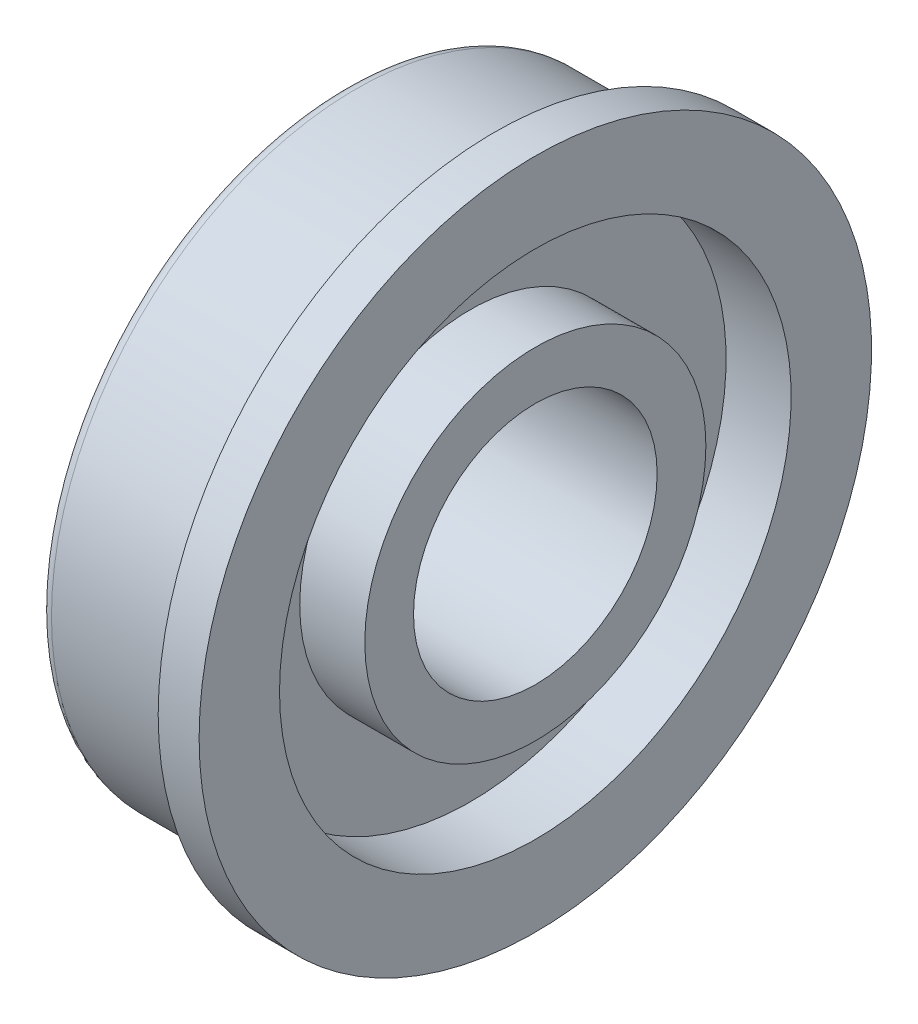
ISO-10303-21;
HEADER;
FILE_DESCRIPTION(('STEP AP214'),'2;1');
FILE_NAME('part.step','',(''),(''),'','','');
FILE_SCHEMA(('AUTOMOTIVE_DESIGN { 1 0 10303 214 1 1 1 1 }'));
ENDSEC;
DATA;
#1=APPLICATION_CONTEXT('core data for automotive mechanical design processes');
#2=APPLICATION_PROTOCOL_DEFINITION('international standard','automotive_design',2000,#1);
#3=PRODUCT_CONTEXT('',#1,'mechanical');
#4=PRODUCT('Part','Part','',(#3));
#5=PRODUCT_RELATED_PRODUCT_CATEGORY('part','',(#4));
#6=PRODUCT_DEFINITION_FORMATION('','',#4);
#7=PRODUCT_DEFINITION_CONTEXT('part definition',#1,'design');
#8=PRODUCT_DEFINITION('design','',#6,#7);
#9=PRODUCT_DEFINITION_SHAPE('','',#8);
#10=(LENGTH_UNIT() NAMED_UNIT(*) SI_UNIT(.MILLI.,.METRE.));
#11=(NAMED_UNIT(*) PLANE_ANGLE_UNIT() SI_UNIT($,.RADIAN.));
#12=(NAMED_UNIT(*) SI_UNIT($,.STERADIAN.) SOLID_ANGLE_UNIT());
#13=UNCERTAINTY_MEASURE_WITH_UNIT(LENGTH_MEASURE(1.E-05),#10,'distance_accuracy_value','');
#14=(GEOMETRIC_REPRESENTATION_CONTEXT(3) GLOBAL_UNCERTAINTY_ASSIGNED_CONTEXT((#13)) GLOBAL_UNIT_ASSIGNED_CONTEXT((#10,
#11,#12)) REPRESENTATION_CONTEXT('',''));
#15=CARTESIAN_POINT('',(0.,0.,0.));
#16=DIRECTION('',(0.,0.,1.));
#17=DIRECTION('',(1.,0.,0.));
#18=AXIS2_PLACEMENT_3D('',#15,#16,#17);
#19=CARTESIAN_POINT('',(4.9784,3.175,0.));
#20=DIRECTION('',(-1.,0.,0.));
#21=DIRECTION('',(0.,0.,1.));
#22=AXIS2_PLACEMENT_3D('',#19,#20,#21);
#23=PLANE('',#22);
#24=CARTESIAN_POINT('',(4.9784,0.,0.));
#25=DIRECTION('',(-1.,0.,0.));
#26=DIRECTION('',(0.,0.,1.));
#27=AXIS2_PLACEMENT_3D('',#24,#25,#26);
#28=CIRCLE('',#27,4.445);
#29=CARTESIAN_POINT('',(4.9784,0.,4.445));
#30=VERTEX_POINT('',#29);
#31=EDGE_CURVE('E10',#30,#30,#28,.T.);
#32=ORIENTED_EDGE('',*,*,#31,.F.);
#33=EDGE_LOOP('',(#32));
#34=FACE_BOUND('',#33,.T.);
#35=CARTESIAN_POINT('',(4.9784,0.,0.));
#36=DIRECTION('',(-1.,0.,0.));
#37=DIRECTION('',(0.,0.,1.));
#38=AXIS2_PLACEMENT_3D('',#35,#36,#37);
#39=CIRCLE('',#38,3.175);
#40=CARTESIAN_POINT('',(4.9784,0.,3.175));
#41=VERTEX_POINT('',#40);
#42=EDGE_CURVE('E85',#41,#41,#39,.T.);
#43=ORIENTED_EDGE('',*,*,#42,.T.);
#44=EDGE_LOOP('',(#43));
#45=FACE_BOUND('',#44,.T.);
#46=ADVANCED_FACE('F33',(#34,#45),#23,.F.);
#47=CARTESIAN_POINT('',(-4.8320583682069,0.,0.));
#48=DIRECTION('',(-1.,0.,0.));
#49=DIRECTION('',(0.,0.,1.));
#50=AXIS2_PLACEMENT_3D('',#47,#48,#49);
#51=CYLINDRICAL_SURFACE('',#50,4.445);
#52=CARTESIAN_POINT('',(3.28295,0.,0.));
#53=DIRECTION('',(-1.,0.,0.));
#54=DIRECTION('',(0.,0.,1.));
#55=AXIS2_PLACEMENT_3D('',#52,#53,#54);
#56=CIRCLE('',#55,4.445);
#57=CARTESIAN_POINT('',(3.28295,0.,4.445));
#58=VERTEX_POINT('',#57);
#59=EDGE_CURVE('E39',#58,#58,#56,.T.);
#60=ORIENTED_EDGE('',*,*,#59,.F.);
#61=EDGE_LOOP('',(#60));
#62=FACE_BOUND('',#61,.T.);
#63=ORIENTED_EDGE('',*,*,#31,.T.);
#64=EDGE_LOOP('',(#63));
#65=FACE_BOUND('',#64,.T.);
#66=ADVANCED_FACE('F170',(#62,#65),#51,.T.);
#67=CARTESIAN_POINT('',(3.28295,4.445,0.));
#68=DIRECTION('',(-1.,0.,0.));
#69=DIRECTION('',(0.,0.,1.));
#70=AXIS2_PLACEMENT_3D('',#67,#68,#69);
#71=PLANE('',#70);
#72=CARTESIAN_POINT('',(3.28295,0.,0.));
#73=DIRECTION('',(-1.,0.,0.));
#74=DIRECTION('',(0.,0.,1.));
#75=AXIS2_PLACEMENT_3D('',#72,#73,#74);
#76=CIRCLE('',#75,6.6675);
#77=CARTESIAN_POINT('',(3.28295,0.,6.6675));
#78=VERTEX_POINT('',#77);
#79=EDGE_CURVE('E43',#78,#78,#76,.T.);
#80=ORIENTED_EDGE('',*,*,#79,.F.);
#81=EDGE_LOOP('',(#80));
#82=FACE_BOUND('',#81,.T.);
#83=ORIENTED_EDGE('',*,*,#59,.T.);
#84=EDGE_LOOP('',(#83));
#85=FACE_BOUND('',#84,.T.);
#86=ADVANCED_FACE('F165',(#82,#85),#71,.F.);
#87=CARTESIAN_POINT('',(-4.8320583682069,0.,0.));
#88=DIRECTION('',(-1.,0.,0.));
#89=DIRECTION('',(0.,0.,1.));
#90=AXIS2_PLACEMENT_3D('',#87,#88,#89);
#91=CYLINDRICAL_SURFACE('',#90,6.6675);
#92=CARTESIAN_POINT('',(4.9784,0.,0.));
#93=DIRECTION('',(-1.,0.,0.));
#94=DIRECTION('',(0.,0.,1.));
#95=AXIS2_PLACEMENT_3D('',#92,#93,#94);
#96=CIRCLE('',#95,6.6675);
#97=CARTESIAN_POINT('',(4.9784,0.,6.6675));
#98=VERTEX_POINT('',#97);
#99=EDGE_CURVE('E47',#98,#98,#96,.T.);
#100=ORIENTED_EDGE('',*,*,#99,.F.);
#101=EDGE_LOOP('',(#100));
#102=FACE_BOUND('',#101,.T.);
#103=ORIENTED_EDGE('',*,*,#79,.T.);
#104=EDGE_LOOP('',(#103));
#105=FACE_BOUND('',#104,.T.);
#106=ADVANCED_FACE('F159',(#102,#105),#91,.F.);
#107=CARTESIAN_POINT('',(4.9784,6.6675,0.));
#108=DIRECTION('',(-1.,0.,0.));
#109=DIRECTION('',(0.,0.,1.));
#110=AXIS2_PLACEMENT_3D('',#107,#108,#109);
#111=PLANE('',#110);
#112=CARTESIAN_POINT('',(4.9784,0.,0.));
#113=DIRECTION('',(-1.,0.,0.));
#114=DIRECTION('',(0.,0.,1.));
#115=AXIS2_PLACEMENT_3D('',#112,#113,#114);
#116=CIRCLE('',#115,8.763);
#117=CARTESIAN_POINT('',(4.9784,0.,8.763));
#118=VERTEX_POINT('',#117);
#119=EDGE_CURVE('E52',#118,#118,#116,.T.);
#120=ORIENTED_EDGE('',*,*,#119,.F.);
#121=EDGE_LOOP('',(#120));
#122=FACE_BOUND('',#121,.T.);
#123=ORIENTED_EDGE('',*,*,#99,.T.);
#124=EDGE_LOOP('',(#123));
#125=FACE_BOUND('',#124,.T.);
#126=ADVANCED_FACE('F153',(#122,#125),#111,.F.);
#127=CARTESIAN_POINT('',(-4.8320583682069,0.,0.));
#128=DIRECTION('',(-1.,0.,0.));
#129=DIRECTION('',(0.,0.,1.));
#130=AXIS2_PLACEMENT_3D('',#127,#128,#129);
#131=CYLINDRICAL_SURFACE('',#130,8.763);
#132=CARTESIAN_POINT('',(3.9116,0.,0.));
#133=DIRECTION('',(-1.,0.,0.));
#134=DIRECTION('',(0.,0.,1.));
#135=AXIS2_PLACEMENT_3D('',#132,#133,#134);
#136=CIRCLE('',#135,8.76299999999999);
#137=CARTESIAN_POINT('',(3.9116,0.,8.76299999999999));
#138=VERTEX_POINT('',#137);
#139=EDGE_CURVE('E55',#138,#138,#136,.T.);
#140=ORIENTED_EDGE('',*,*,#139,.F.);
#141=EDGE_LOOP('',(#140));
#142=FACE_BOUND('',#141,.T.);
#143=ORIENTED_EDGE('',*,*,#119,.T.);
#144=EDGE_LOOP('',(#143));
#145=FACE_BOUND('',#144,.T.);
#146=ADVANCED_FACE('F147',(#142,#145),#131,.T.);
#147=CARTESIAN_POINT('',(3.9116,8.76299999999999,0.));
#148=DIRECTION('',(1.,0.,0.));
#149=DIRECTION('',(0.,0.,-1.));
#150=AXIS2_PLACEMENT_3D('',#147,#148,#149);
#151=PLANE('',#150);
#152=CARTESIAN_POINT('',(3.9116,0.,0.));
#153=DIRECTION('',(-1.,0.,0.));
#154=DIRECTION('',(0.,0.,1.));
#155=AXIS2_PLACEMENT_3D('',#152,#153,#154);
#156=CIRCLE('',#155,7.9375);
#157=CARTESIAN_POINT('',(3.9116,0.,7.9375));
#158=VERTEX_POINT('',#157);
#159=EDGE_CURVE('E58',#158,#158,#156,.T.);
#160=ORIENTED_EDGE('',*,*,#159,.F.);
#161=EDGE_LOOP('',(#160));
#162=FACE_BOUND('',#161,.T.);
#163=ORIENTED_EDGE('',*,*,#139,.T.);
#164=EDGE_LOOP('',(#163));
#165=FACE_BOUND('',#164,.T.);
#166=ADVANCED_FACE('F141',(#162,#165),#151,.F.);
#167=CARTESIAN_POINT('',(-4.8320583682069,0.,0.));
#168=DIRECTION('',(-1.,0.,0.));
#169=DIRECTION('',(0.,0.,1.));
#170=AXIS2_PLACEMENT_3D('',#167,#168,#169);
#171=CYLINDRICAL_SURFACE('',#170,7.9375);
#172=CARTESIAN_POINT('',(0.304799999999999,0.,0.));
#173=DIRECTION('',(-1.,0.,0.));
#174=DIRECTION('',(0.,0.,1.));
#175=AXIS2_PLACEMENT_3D('',#172,#173,#174);
#176=CIRCLE('',#175,7.9375);
#177=CARTESIAN_POINT('',(0.304799999999999,0.,7.9375));
#178=VERTEX_POINT('',#177);
#179=EDGE_CURVE('E61',#178,#178,#176,.T.);
#180=ORIENTED_EDGE('',*,*,#179,.F.);
#181=EDGE_LOOP('',(#180));
#182=FACE_BOUND('',#181,.T.);
#183=ORIENTED_EDGE('',*,*,#159,.T.);
#184=EDGE_LOOP('',(#183));
#185=FACE_BOUND('',#184,.T.);
#186=ADVANCED_FACE('F135',(#182,#185),#171,.T.);
#187=CARTESIAN_POINT('',(0.304799999999999,0.,0.));
#188=DIRECTION('',(-1.,0.,0.));
#189=DIRECTION('',(0.,0.,1.));
#190=AXIS2_PLACEMENT_3D('',#187,#188,#189);
#191=TOROIDAL_SURFACE('',#190,7.6327,0.304799999999998);
#192=CARTESIAN_POINT('',(0.,0.,0.));
#193=DIRECTION('',(-1.,0.,0.));
#194=DIRECTION('',(0.,0.,1.));
#195=AXIS2_PLACEMENT_3D('',#192,#193,#194);
#196=CIRCLE('',#195,7.6327);
#197=CARTESIAN_POINT('',(0.,0.,7.6327));
#198=VERTEX_POINT('',#197);
#199=EDGE_CURVE('E64',#198,#198,#196,.T.);
#200=ORIENTED_EDGE('',*,*,#199,.F.);
#201=EDGE_LOOP('',(#200));
#202=FACE_BOUND('',#201,.T.);
#203=ORIENTED_EDGE('',*,*,#179,.T.);
#204=EDGE_LOOP('',(#203));
#205=FACE_BOUND('',#204,.T.);
#206=ADVANCED_FACE('F129',(#202,#205),#191,.T.);
#207=CARTESIAN_POINT('',(0.,7.6327,0.));
#208=DIRECTION('',(1.,0.,0.));
#209=DIRECTION('',(0.,0.,-1.));
#210=AXIS2_PLACEMENT_3D('',#207,#208,#209);
#211=PLANE('',#210);
#212=CARTESIAN_POINT('',(0.,0.,0.));
#213=DIRECTION('',(-1.,0.,0.));
#214=DIRECTION('',(0.,0.,1.));
#215=AXIS2_PLACEMENT_3D('',#212,#213,#214);
#216=CIRCLE('',#215,6.6675);
#217=CARTESIAN_POINT('',(0.,0.,6.6675));
#218=VERTEX_POINT('',#217);
#219=EDGE_CURVE('E67',#218,#218,#216,.T.);
#220=ORIENTED_EDGE('',*,*,#219,.F.);
#221=EDGE_LOOP('',(#220));
#222=FACE_BOUND('',#221,.T.);
#223=ORIENTED_EDGE('',*,*,#199,.T.);
#224=EDGE_LOOP('',(#223));
#225=FACE_BOUND('',#224,.T.);
#226=ADVANCED_FACE('F123',(#222,#225),#211,.F.);
#227=CARTESIAN_POINT('',(-4.8320583682069,0.,0.));
#228=DIRECTION('',(-1.,0.,0.));
#229=DIRECTION('',(0.,0.,1.));
#230=AXIS2_PLACEMENT_3D('',#227,#228,#229);
#231=CYLINDRICAL_SURFACE('',#230,6.6675);
#232=CARTESIAN_POINT('',(1.69545,0.,0.));
#233=DIRECTION('',(-1.,0.,0.));
#234=DIRECTION('',(0.,0.,1.));
#235=AXIS2_PLACEMENT_3D('',#232,#233,#234);
#236=CIRCLE('',#235,6.6675);
#237=CARTESIAN_POINT('',(1.69545,0.,6.6675));
#238=VERTEX_POINT('',#237);
#239=EDGE_CURVE('E70',#238,#238,#236,.T.);
#240=ORIENTED_EDGE('',*,*,#239,.F.);
#241=EDGE_LOOP('',(#240));
#242=FACE_BOUND('',#241,.T.);
#243=ORIENTED_EDGE('',*,*,#219,.T.);
#244=EDGE_LOOP('',(#243));
#245=FACE_BOUND('',#244,.T.);
#246=ADVANCED_FACE('F117',(#242,#245),#231,.F.);
#247=CARTESIAN_POINT('',(1.69545,6.6675,0.));
#248=DIRECTION('',(1.,0.,0.));
#249=DIRECTION('',(0.,0.,-1.));
#250=AXIS2_PLACEMENT_3D('',#247,#248,#249);
#251=PLANE('',#250);
#252=CARTESIAN_POINT('',(1.69545,0.,0.));
#253=DIRECTION('',(-1.,0.,0.));
#254=DIRECTION('',(0.,0.,1.));
#255=AXIS2_PLACEMENT_3D('',#252,#253,#254);
#256=CIRCLE('',#255,4.445);
#257=CARTESIAN_POINT('',(1.69545,0.,4.445));
#258=VERTEX_POINT('',#257);
#259=EDGE_CURVE('E73',#258,#258,#256,.T.);
#260=ORIENTED_EDGE('',*,*,#259,.F.);
#261=EDGE_LOOP('',(#260));
#262=FACE_BOUND('',#261,.T.);
#263=ORIENTED_EDGE('',*,*,#239,.T.);
#264=EDGE_LOOP('',(#263));
#265=FACE_BOUND('',#264,.T.);
#266=ADVANCED_FACE('F111',(#262,#265),#251,.F.);
#267=CARTESIAN_POINT('',(-4.8320583682069,0.,0.));
#268=DIRECTION('',(-1.,0.,0.));
#269=DIRECTION('',(0.,0.,1.));
#270=AXIS2_PLACEMENT_3D('',#267,#268,#269);
#271=CYLINDRICAL_SURFACE('',#270,4.445);
#272=CARTESIAN_POINT('',(0.,0.,0.));
#273=DIRECTION('',(-1.,0.,0.));
#274=DIRECTION('',(0.,0.,1.));
#275=AXIS2_PLACEMENT_3D('',#272,#273,#274);
#276=CIRCLE('',#275,4.445);
#277=CARTESIAN_POINT('',(0.,0.,4.445));
#278=VERTEX_POINT('',#277);
#279=EDGE_CURVE('E76',#278,#278,#276,.T.);
#280=ORIENTED_EDGE('',*,*,#279,.F.);
#281=EDGE_LOOP('',(#280));
#282=FACE_BOUND('',#281,.T.);
#283=ORIENTED_EDGE('',*,*,#259,.T.);
#284=EDGE_LOOP('',(#283));
#285=FACE_BOUND('',#284,.T.);
#286=ADVANCED_FACE('F105',(#282,#285),#271,.T.);
#287=CARTESIAN_POINT('',(0.,4.445,0.));
#288=DIRECTION('',(1.,0.,0.));
#289=DIRECTION('',(0.,0.,-1.));
#290=AXIS2_PLACEMENT_3D('',#287,#288,#289);
#291=PLANE('',#290);
#292=CARTESIAN_POINT('',(0.,0.,0.));
#293=DIRECTION('',(-1.,0.,0.));
#294=DIRECTION('',(0.,0.,1.));
#295=AXIS2_PLACEMENT_3D('',#292,#293,#294);
#296=CIRCLE('',#295,3.4798);
#297=CARTESIAN_POINT('',(0.,0.,3.4798));
#298=VERTEX_POINT('',#297);
#299=EDGE_CURVE('E79',#298,#298,#296,.T.);
#300=ORIENTED_EDGE('',*,*,#299,.F.);
#301=EDGE_LOOP('',(#300));
#302=FACE_BOUND('',#301,.T.);
#303=ORIENTED_EDGE('',*,*,#279,.T.);
#304=EDGE_LOOP('',(#303));
#305=FACE_BOUND('',#304,.T.);
#306=ADVANCED_FACE('F99',(#302,#305),#291,.F.);
#307=CARTESIAN_POINT('',(0.3048,0.,0.));
#308=DIRECTION('',(-1.,0.,0.));
#309=DIRECTION('',(0.,0.,1.));
#310=AXIS2_PLACEMENT_3D('',#307,#308,#309);
#311=TOROIDAL_SURFACE('',#310,3.4798,0.3048);
#312=CARTESIAN_POINT('',(0.3048,0.,0.));
#313=DIRECTION('',(-1.,0.,0.));
#314=DIRECTION('',(0.,0.,1.));
#315=AXIS2_PLACEMENT_3D('',#312,#313,#314);
#316=CIRCLE('',#315,3.175);
#317=CARTESIAN_POINT('',(0.3048,0.,3.175));
#318=VERTEX_POINT('',#317);
#319=EDGE_CURVE('E82',#318,#318,#316,.T.);
#320=ORIENTED_EDGE('',*,*,#319,.F.);
#321=EDGE_LOOP('',(#320));
#322=FACE_BOUND('',#321,.T.);
#323=ORIENTED_EDGE('',*,*,#299,.T.);
#324=EDGE_LOOP('',(#323));
#325=FACE_BOUND('',#324,.T.);
#326=ADVANCED_FACE('F93',(#322,#325),#311,.T.);
#327=CARTESIAN_POINT('',(-4.8320583682069,0.,0.));
#328=DIRECTION('',(-1.,0.,0.));
#329=DIRECTION('',(0.,0.,1.));
#330=AXIS2_PLACEMENT_3D('',#327,#328,#329);
#331=CYLINDRICAL_SURFACE('',#330,3.175);
#332=ORIENTED_EDGE('',*,*,#42,.F.);
#333=EDGE_LOOP('',(#332));
#334=FACE_BOUND('',#333,.T.);
#335=ORIENTED_EDGE('',*,*,#319,.T.);
#336=EDGE_LOOP('',(#335));
#337=FACE_BOUND('',#336,.T.);
#338=ADVANCED_FACE('F90',(#334,#337),#331,.F.);
#339=CLOSED_SHELL('',(#46,#66,#86,#106,#126,#146,#166,#186,#206,#226,#246,#266,#286,#306,#326,#338));
#340=MANIFOLD_SOLID_BREP('B2',#339);
#341=ADVANCED_BREP_SHAPE_REPRESENTATION('',(#18,#340),#14);
#342=SHAPE_DEFINITION_REPRESENTATION(#9,#341);
ENDSEC;
END-ISO-10303-21;
